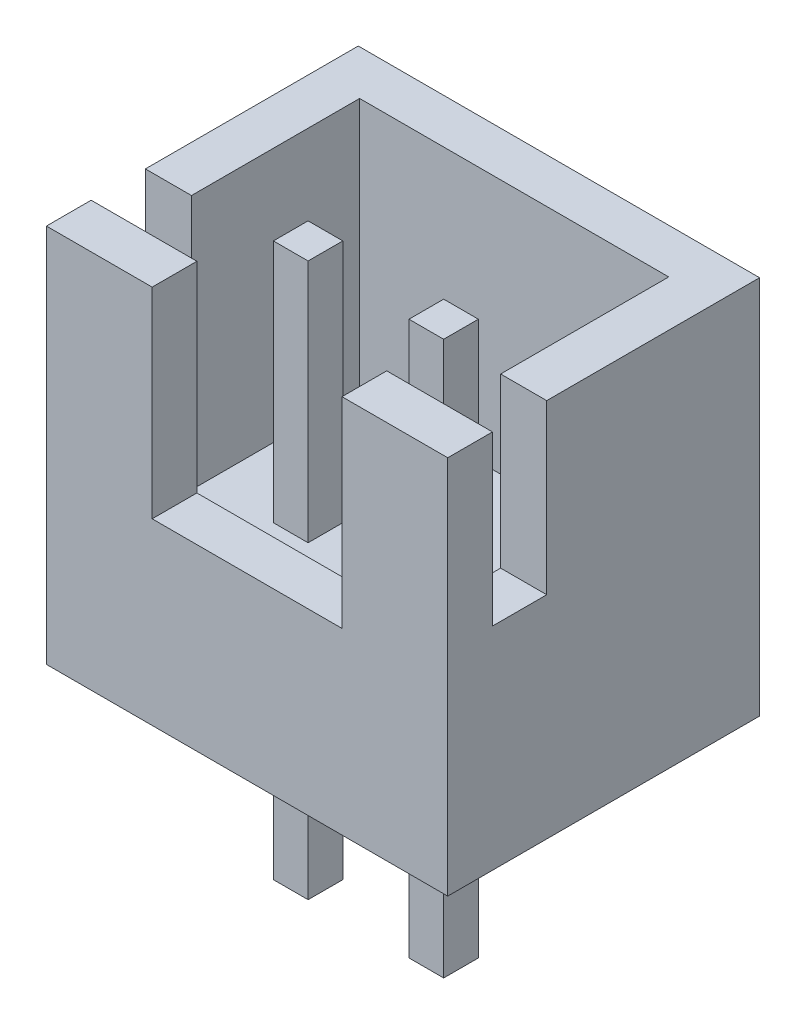
ISO-10303-21;
HEADER;
FILE_DESCRIPTION(('STEP AP214'),'2;1');
FILE_NAME('part.step','',(''),(''),'','','');
FILE_SCHEMA(('AUTOMOTIVE_DESIGN { 1 0 10303 214 1 1 1 1 }'));
ENDSEC;
DATA;
#1=APPLICATION_CONTEXT('core data for automotive mechanical design processes');
#2=APPLICATION_PROTOCOL_DEFINITION('international standard','automotive_design',2000,#1);
#3=PRODUCT_CONTEXT('',#1,'mechanical');
#4=PRODUCT('Part','Part','',(#3));
#5=PRODUCT_RELATED_PRODUCT_CATEGORY('part','',(#4));
#6=PRODUCT_DEFINITION_FORMATION('','',#4);
#7=PRODUCT_DEFINITION_CONTEXT('part definition',#1,'design');
#8=PRODUCT_DEFINITION('design','',#6,#7);
#9=PRODUCT_DEFINITION_SHAPE('','',#8);
#10=(LENGTH_UNIT() NAMED_UNIT(*) SI_UNIT(.MILLI.,.METRE.));
#11=(NAMED_UNIT(*) PLANE_ANGLE_UNIT() SI_UNIT($,.RADIAN.));
#12=(NAMED_UNIT(*) SI_UNIT($,.STERADIAN.) SOLID_ANGLE_UNIT());
#13=UNCERTAINTY_MEASURE_WITH_UNIT(LENGTH_MEASURE(1.E-05),#10,'distance_accuracy_value','');
#14=(GEOMETRIC_REPRESENTATION_CONTEXT(3) GLOBAL_UNCERTAINTY_ASSIGNED_CONTEXT((#13)) GLOBAL_UNIT_ASSIGNED_CONTEXT((#10,
#11,#12)) REPRESENTATION_CONTEXT('',''));
#15=CARTESIAN_POINT('',(0.,0.,0.));
#16=DIRECTION('',(0.,0.,1.));
#17=DIRECTION('',(1.,0.,0.));
#18=AXIS2_PLACEMENT_3D('',#15,#16,#17);
#19=CARTESIAN_POINT('',(0.93,7.705096679919,0.82));
#20=DIRECTION('',(0.,0.,-1.));
#21=DIRECTION('',(-1.,0.,0.));
#22=AXIS2_PLACEMENT_3D('',#19,#20,#21);
#23=PLANE('',#22);
#24=DIRECTION('',(-1.,0.,0.));
#25=VECTOR('',#24,1.);
#26=CARTESIAN_POINT('',(0.93,2.3,0.82));
#27=LINE('',#26,#25);
#28=CARTESIAN_POINT('',(1.57,2.3,0.82));
#29=VERTEX_POINT('',#28);
#30=CARTESIAN_POINT('',(0.93,2.3,0.82));
#31=VERTEX_POINT('',#30);
#32=EDGE_CURVE('E20',#29,#31,#27,.T.);
#33=ORIENTED_EDGE('',*,*,#32,.F.);
#34=DIRECTION('',(0.,1.,0.));
#35=VECTOR('',#34,1.);
#36=CARTESIAN_POINT('',(1.57,7.705096679919,0.82));
#37=LINE('',#36,#35);
#38=CARTESIAN_POINT('',(1.57,6.8,0.82));
#39=VERTEX_POINT('',#38);
#40=EDGE_CURVE('E242',#29,#39,#37,.T.);
#41=ORIENTED_EDGE('',*,*,#40,.T.);
#42=DIRECTION('',(1.,0.,0.));
#43=VECTOR('',#42,1.);
#44=CARTESIAN_POINT('',(0.,6.8,0.82));
#45=LINE('',#44,#43);
#46=CARTESIAN_POINT('',(0.93,6.8,0.82));
#47=VERTEX_POINT('',#46);
#48=EDGE_CURVE('E238',#39,#47,#45,.F.);
#49=ORIENTED_EDGE('',*,*,#48,.T.);
#50=DIRECTION('',(0.,1.,0.));
#51=VECTOR('',#50,1.);
#52=CARTESIAN_POINT('',(0.93,7.705096679919,0.82));
#53=LINE('',#52,#51);
#54=EDGE_CURVE('E240',#47,#31,#53,.F.);
#55=ORIENTED_EDGE('',*,*,#54,.T.);
#56=EDGE_LOOP('',(#33,#41,#49,#55));
#57=FACE_BOUND('',#56,.T.);
#58=ADVANCED_FACE('F17',(#57),#23,.F.);
#59=CARTESIAN_POINT('',(-1.57,7.705096679919,0.82));
#60=DIRECTION('',(0.,0.,-1.));
#61=DIRECTION('',(-1.,0.,0.));
#62=AXIS2_PLACEMENT_3D('',#59,#60,#61);
#63=PLANE('',#62);
#64=DIRECTION('',(-1.,0.,0.));
#65=VECTOR('',#64,1.);
#66=CARTESIAN_POINT('',(-1.57,2.3,0.82));
#67=LINE('',#66,#65);
#68=CARTESIAN_POINT('',(-0.93,2.3,0.82));
#69=VERTEX_POINT('',#68);
#70=CARTESIAN_POINT('',(-1.57,2.3,0.82));
#71=VERTEX_POINT('',#70);
#72=EDGE_CURVE('E248',#69,#71,#67,.T.);
#73=ORIENTED_EDGE('',*,*,#72,.F.);
#74=DIRECTION('',(0.,1.,0.));
#75=VECTOR('',#74,1.);
#76=CARTESIAN_POINT('',(-0.93,7.705096679919,0.82));
#77=LINE('',#76,#75);
#78=CARTESIAN_POINT('',(-0.93,6.8,0.82));
#79=VERTEX_POINT('',#78);
#80=EDGE_CURVE('E363',#69,#79,#77,.T.);
#81=ORIENTED_EDGE('',*,*,#80,.T.);
#82=DIRECTION('',(1.,0.,0.));
#83=VECTOR('',#82,1.);
#84=CARTESIAN_POINT('',(0.,6.8,0.82));
#85=LINE('',#84,#83);
#86=CARTESIAN_POINT('',(-1.57,6.8,0.82));
#87=VERTEX_POINT('',#86);
#88=EDGE_CURVE('E285',#79,#87,#85,.F.);
#89=ORIENTED_EDGE('',*,*,#88,.T.);
#90=DIRECTION('',(0.,1.,0.));
#91=VECTOR('',#90,1.);
#92=CARTESIAN_POINT('',(-1.57,7.705096679919,0.82));
#93=LINE('',#92,#91);
#94=EDGE_CURVE('E277',#87,#71,#93,.F.);
#95=ORIENTED_EDGE('',*,*,#94,.T.);
#96=EDGE_LOOP('',(#73,#81,#89,#95));
#97=FACE_BOUND('',#96,.T.);
#98=ADVANCED_FACE('F284',(#97),#63,.F.);
#99=CARTESIAN_POINT('',(0.,6.8,0.5));
#100=DIRECTION('',(0.,-1.,0.));
#101=DIRECTION('',(0.,0.,-1.));
#102=AXIS2_PLACEMENT_3D('',#99,#100,#101);
#103=PLANE('',#102);
#104=DIRECTION('',(0.,0.,1.));
#105=VECTOR('',#104,1.);
#106=CARTESIAN_POINT('',(1.57,6.8,0.82));
#107=LINE('',#106,#105);
#108=CARTESIAN_POINT('',(1.57,6.8,0.18));
#109=VERTEX_POINT('',#108);
#110=EDGE_CURVE('E295',#39,#109,#107,.F.);
#111=ORIENTED_EDGE('',*,*,#110,.T.);
#112=DIRECTION('',(1.,0.,0.));
#113=VECTOR('',#112,1.);
#114=CARTESIAN_POINT('',(0.93,6.8,0.18));
#115=LINE('',#114,#113);
#116=CARTESIAN_POINT('',(0.93,6.8,0.18));
#117=VERTEX_POINT('',#116);
#118=EDGE_CURVE('E258',#109,#117,#115,.F.);
#119=ORIENTED_EDGE('',*,*,#118,.T.);
#120=DIRECTION('',(0.,0.,-1.));
#121=VECTOR('',#120,1.);
#122=CARTESIAN_POINT('',(0.93,6.8,0.82));
#123=LINE('',#122,#121);
#124=EDGE_CURVE('E247',#117,#47,#123,.F.);
#125=ORIENTED_EDGE('',*,*,#124,.T.);
#126=ORIENTED_EDGE('',*,*,#48,.F.);
#127=EDGE_LOOP('',(#111,#119,#125,#126));
#128=FACE_BOUND('',#127,.T.);
#129=ADVANCED_FACE('F257',(#128),#103,.F.);
#130=CARTESIAN_POINT('',(0.93,7.705096679919,0.82));
#131=DIRECTION('',(1.,0.,0.));
#132=DIRECTION('',(0.,0.,-1.));
#133=AXIS2_PLACEMENT_3D('',#130,#131,#132);
#134=PLANE('',#133);
#135=DIRECTION('',(0.,0.,-1.));
#136=VECTOR('',#135,1.);
#137=CARTESIAN_POINT('',(0.93,2.3,0.82));
#138=LINE('',#137,#136);
#139=CARTESIAN_POINT('',(0.93,2.3,0.18));
#140=VERTEX_POINT('',#139);
#141=EDGE_CURVE('E254',#31,#140,#138,.T.);
#142=ORIENTED_EDGE('',*,*,#141,.F.);
#143=ORIENTED_EDGE('',*,*,#54,.F.);
#144=ORIENTED_EDGE('',*,*,#124,.F.);
#145=DIRECTION('',(0.,1.,0.));
#146=VECTOR('',#145,1.);
#147=CARTESIAN_POINT('',(0.93,7.705096679919,0.18));
#148=LINE('',#147,#146);
#149=EDGE_CURVE('E299',#117,#140,#148,.F.);
#150=ORIENTED_EDGE('',*,*,#149,.T.);
#151=EDGE_LOOP('',(#142,#143,#144,#150));
#152=FACE_BOUND('',#151,.T.);
#153=ADVANCED_FACE('F251',(#152),#134,.F.);
#154=CARTESIAN_POINT('',(1.57,7.705096679919,0.82));
#155=DIRECTION('',(-1.,0.,0.));
#156=DIRECTION('',(0.,0.,1.));
#157=AXIS2_PLACEMENT_3D('',#154,#155,#156);
#158=PLANE('',#157);
#159=DIRECTION('',(0.,0.,1.));
#160=VECTOR('',#159,1.);
#161=CARTESIAN_POINT('',(1.57,2.3,0.82));
#162=LINE('',#161,#160);
#163=CARTESIAN_POINT('',(1.57,2.3,0.18));
#164=VERTEX_POINT('',#163);
#165=EDGE_CURVE('E293',#164,#29,#162,.T.);
#166=ORIENTED_EDGE('',*,*,#165,.F.);
#167=DIRECTION('',(0.,1.,0.));
#168=VECTOR('',#167,1.);
#169=CARTESIAN_POINT('',(1.57,7.705096679919,0.18));
#170=LINE('',#169,#168);
#171=EDGE_CURVE('E301',#164,#109,#170,.T.);
#172=ORIENTED_EDGE('',*,*,#171,.T.);
#173=ORIENTED_EDGE('',*,*,#110,.F.);
#174=ORIENTED_EDGE('',*,*,#40,.F.);
#175=EDGE_LOOP('',(#166,#172,#173,#174));
#176=FACE_BOUND('',#175,.T.);
#177=ADVANCED_FACE('F666',(#176),#158,.F.);
#178=CARTESIAN_POINT('',(0.,6.8,0.5));
#179=DIRECTION('',(0.,-1.,0.));
#180=DIRECTION('',(0.,0.,-1.));
#181=AXIS2_PLACEMENT_3D('',#178,#179,#180);
#182=PLANE('',#181);
#183=DIRECTION('',(0.,0.,1.));
#184=VECTOR('',#183,1.);
#185=CARTESIAN_POINT('',(-0.93,6.8,0.82));
#186=LINE('',#185,#184);
#187=CARTESIAN_POINT('',(-0.93,6.8,0.18));
#188=VERTEX_POINT('',#187);
#189=EDGE_CURVE('E282',#79,#188,#186,.F.);
#190=ORIENTED_EDGE('',*,*,#189,.T.);
#191=DIRECTION('',(1.,0.,0.));
#192=VECTOR('',#191,1.);
#193=CARTESIAN_POINT('',(-1.57,6.8,0.18));
#194=LINE('',#193,#192);
#195=CARTESIAN_POINT('',(-1.57,6.8,0.18));
#196=VERTEX_POINT('',#195);
#197=EDGE_CURVE('E354',#188,#196,#194,.F.);
#198=ORIENTED_EDGE('',*,*,#197,.T.);
#199=DIRECTION('',(0.,0.,-1.));
#200=VECTOR('',#199,1.);
#201=CARTESIAN_POINT('',(-1.57,6.8,0.82));
#202=LINE('',#201,#200);
#203=EDGE_CURVE('E286',#196,#87,#202,.F.);
#204=ORIENTED_EDGE('',*,*,#203,.T.);
#205=ORIENTED_EDGE('',*,*,#88,.F.);
#206=EDGE_LOOP('',(#190,#198,#204,#205));
#207=FACE_BOUND('',#206,.T.);
#208=ADVANCED_FACE('F368',(#207),#182,.F.);
#209=CARTESIAN_POINT('',(-1.57,7.705096679919,0.82));
#210=DIRECTION('',(1.,0.,0.));
#211=DIRECTION('',(0.,0.,-1.));
#212=AXIS2_PLACEMENT_3D('',#209,#210,#211);
#213=PLANE('',#212);
#214=DIRECTION('',(0.,0.,-1.));
#215=VECTOR('',#214,1.);
#216=CARTESIAN_POINT('',(-1.57,2.3,0.82));
#217=LINE('',#216,#215);
#218=CARTESIAN_POINT('',(-1.57,2.3,0.18));
#219=VERTEX_POINT('',#218);
#220=EDGE_CURVE('E267',#71,#219,#217,.T.);
#221=ORIENTED_EDGE('',*,*,#220,.F.);
#222=ORIENTED_EDGE('',*,*,#94,.F.);
#223=ORIENTED_EDGE('',*,*,#203,.F.);
#224=DIRECTION('',(0.,1.,0.));
#225=VECTOR('',#224,1.);
#226=CARTESIAN_POINT('',(-1.57,7.705096679919,0.18));
#227=LINE('',#226,#225);
#228=EDGE_CURVE('E280',#196,#219,#227,.F.);
#229=ORIENTED_EDGE('',*,*,#228,.T.);
#230=EDGE_LOOP('',(#221,#222,#223,#229));
#231=FACE_BOUND('',#230,.T.);
#232=ADVANCED_FACE('F276',(#231),#213,.F.);
#233=CARTESIAN_POINT('',(-0.93,7.705096679919,0.82));
#234=DIRECTION('',(-1.,0.,0.));
#235=DIRECTION('',(0.,0.,1.));
#236=AXIS2_PLACEMENT_3D('',#233,#234,#235);
#237=PLANE('',#236);
#238=DIRECTION('',(0.,0.,1.));
#239=VECTOR('',#238,1.);
#240=CARTESIAN_POINT('',(-0.93,2.3,0.82));
#241=LINE('',#240,#239);
#242=CARTESIAN_POINT('',(-0.93,2.3,0.18));
#243=VERTEX_POINT('',#242);
#244=EDGE_CURVE('E269',#243,#69,#241,.T.);
#245=ORIENTED_EDGE('',*,*,#244,.F.);
#246=DIRECTION('',(0.,1.,0.));
#247=VECTOR('',#246,1.);
#248=CARTESIAN_POINT('',(-0.93,7.705096679919,0.18));
#249=LINE('',#248,#247);
#250=EDGE_CURVE('E350',#243,#188,#249,.T.);
#251=ORIENTED_EDGE('',*,*,#250,.T.);
#252=ORIENTED_EDGE('',*,*,#189,.F.);
#253=ORIENTED_EDGE('',*,*,#80,.F.);
#254=EDGE_LOOP('',(#245,#251,#252,#253));
#255=FACE_BOUND('',#254,.T.);
#256=ADVANCED_FACE('F371',(#255),#237,.F.);
#257=CARTESIAN_POINT('',(0.93,7.705096679919,0.82));
#258=DIRECTION('',(0.,0.,-1.));
#259=DIRECTION('',(-1.,0.,0.));
#260=AXIS2_PLACEMENT_3D('',#257,#258,#259);
#261=PLANE('',#260);
#262=DIRECTION('',(-1.,0.,0.));
#263=VECTOR('',#262,1.);
#264=CARTESIAN_POINT('',(0.93,0.,0.82));
#265=LINE('',#264,#263);
#266=CARTESIAN_POINT('',(0.93,0.,0.82));
#267=VERTEX_POINT('',#266);
#268=CARTESIAN_POINT('',(1.57,0.,0.82));
#269=VERTEX_POINT('',#268);
#270=EDGE_CURVE('E361',#267,#269,#265,.F.);
#271=ORIENTED_EDGE('',*,*,#270,.F.);
#272=DIRECTION('',(0.,1.,0.));
#273=VECTOR('',#272,1.);
#274=CARTESIAN_POINT('',(0.93,7.705096679919,0.82));
#275=LINE('',#274,#273);
#276=CARTESIAN_POINT('',(0.93,-3.4,0.82));
#277=VERTEX_POINT('',#276);
#278=EDGE_CURVE('E331',#267,#277,#275,.F.);
#279=ORIENTED_EDGE('',*,*,#278,.T.);
#280=DIRECTION('',(1.,0.,0.));
#281=VECTOR('',#280,1.);
#282=CARTESIAN_POINT('',(0.93,-3.4,0.82));
#283=LINE('',#282,#281);
#284=CARTESIAN_POINT('',(1.57,-3.4,0.82));
#285=VERTEX_POINT('',#284);
#286=EDGE_CURVE('E348',#285,#277,#283,.F.);
#287=ORIENTED_EDGE('',*,*,#286,.F.);
#288=DIRECTION('',(0.,1.,0.));
#289=VECTOR('',#288,1.);
#290=CARTESIAN_POINT('',(1.57,7.705096679919,0.82));
#291=LINE('',#290,#289);
#292=EDGE_CURVE('E342',#285,#269,#291,.T.);
#293=ORIENTED_EDGE('',*,*,#292,.T.);
#294=EDGE_LOOP('',(#271,#279,#287,#293));
#295=FACE_BOUND('',#294,.T.);
#296=ADVANCED_FACE('F505',(#295),#261,.F.);
#297=CARTESIAN_POINT('',(-1.57,7.705096679919,0.82));
#298=DIRECTION('',(0.,0.,-1.));
#299=DIRECTION('',(-1.,0.,0.));
#300=AXIS2_PLACEMENT_3D('',#297,#298,#299);
#301=PLANE('',#300);
#302=DIRECTION('',(-1.,0.,0.));
#303=VECTOR('',#302,1.);
#304=CARTESIAN_POINT('',(-1.57,0.,0.82));
#305=LINE('',#304,#303);
#306=CARTESIAN_POINT('',(-1.57,0.,0.82));
#307=VERTEX_POINT('',#306);
#308=CARTESIAN_POINT('',(-0.93,0.,0.82));
#309=VERTEX_POINT('',#308);
#310=EDGE_CURVE('E359',#307,#309,#305,.F.);
#311=ORIENTED_EDGE('',*,*,#310,.F.);
#312=DIRECTION('',(0.,1.,0.));
#313=VECTOR('',#312,1.);
#314=CARTESIAN_POINT('',(-1.57,7.705096679919,0.82));
#315=LINE('',#314,#313);
#316=CARTESIAN_POINT('',(-1.57,-3.4,0.82));
#317=VERTEX_POINT('',#316);
#318=EDGE_CURVE('E307',#307,#317,#315,.F.);
#319=ORIENTED_EDGE('',*,*,#318,.T.);
#320=DIRECTION('',(1.,0.,0.));
#321=VECTOR('',#320,1.);
#322=CARTESIAN_POINT('',(-1.57,-3.4,0.82));
#323=LINE('',#322,#321);
#324=CARTESIAN_POINT('',(-0.93,-3.4,0.82));
#325=VERTEX_POINT('',#324);
#326=EDGE_CURVE('E329',#325,#317,#323,.F.);
#327=ORIENTED_EDGE('',*,*,#326,.F.);
#328=DIRECTION('',(0.,1.,0.));
#329=VECTOR('',#328,1.);
#330=CARTESIAN_POINT('',(-0.93,7.705096679919,0.82));
#331=LINE('',#330,#329);
#332=EDGE_CURVE('E323',#325,#309,#331,.T.);
#333=ORIENTED_EDGE('',*,*,#332,.T.);
#334=EDGE_LOOP('',(#311,#319,#327,#333));
#335=FACE_BOUND('',#334,.T.);
#336=ADVANCED_FACE('F385',(#335),#301,.F.);
#337=CARTESIAN_POINT('',(0.93,7.705096679919,0.18));
#338=DIRECTION('',(0.,0.,1.));
#339=DIRECTION('',(1.,0.,0.));
#340=AXIS2_PLACEMENT_3D('',#337,#338,#339);
#341=PLANE('',#340);
#342=DIRECTION('',(1.,0.,0.));
#343=VECTOR('',#342,1.);
#344=CARTESIAN_POINT('',(-2.85,2.3,0.18));
#345=LINE('',#344,#343);
#346=EDGE_CURVE('E298',#164,#140,#345,.F.);
#347=ORIENTED_EDGE('',*,*,#346,.T.);
#348=ORIENTED_EDGE('',*,*,#149,.F.);
#349=ORIENTED_EDGE('',*,*,#118,.F.);
#350=ORIENTED_EDGE('',*,*,#171,.F.);
#351=EDGE_LOOP('',(#347,#348,#349,#350));
#352=FACE_BOUND('',#351,.T.);
#353=ADVANCED_FACE('F304',(#352),#341,.F.);
#354=CARTESIAN_POINT('',(-1.57,7.705096679919,0.18));
#355=DIRECTION('',(0.,0.,1.));
#356=DIRECTION('',(1.,0.,0.));
#357=AXIS2_PLACEMENT_3D('',#354,#355,#356);
#358=PLANE('',#357);
#359=DIRECTION('',(1.,0.,0.));
#360=VECTOR('',#359,1.);
#361=CARTESIAN_POINT('',(-2.85,2.3,0.18));
#362=LINE('',#361,#360);
#363=EDGE_CURVE('E306',#243,#219,#362,.F.);
#364=ORIENTED_EDGE('',*,*,#363,.T.);
#365=ORIENTED_EDGE('',*,*,#228,.F.);
#366=ORIENTED_EDGE('',*,*,#197,.F.);
#367=ORIENTED_EDGE('',*,*,#250,.F.);
#368=EDGE_LOOP('',(#364,#365,#366,#367));
#369=FACE_BOUND('',#368,.T.);
#370=ADVANCED_FACE('F373',(#369),#358,.F.);
#371=CARTESIAN_POINT('',(0.93,-3.4,0.18));
#372=DIRECTION('',(0.,-1.,0.));
#373=DIRECTION('',(0.,0.,-1.));
#374=AXIS2_PLACEMENT_3D('',#371,#372,#373);
#375=PLANE('',#374);
#376=DIRECTION('',(0.,0.,1.));
#377=VECTOR('',#376,1.);
#378=CARTESIAN_POINT('',(1.57,-3.4,0.82));
#379=LINE('',#378,#377);
#380=CARTESIAN_POINT('',(1.57,-3.4,0.18));
#381=VERTEX_POINT('',#380);
#382=EDGE_CURVE('E345',#381,#285,#379,.T.);
#383=ORIENTED_EDGE('',*,*,#382,.T.);
#384=ORIENTED_EDGE('',*,*,#286,.T.);
#385=DIRECTION('',(0.,0.,-1.));
#386=VECTOR('',#385,1.);
#387=CARTESIAN_POINT('',(0.93,-3.4,0.82));
#388=LINE('',#387,#386);
#389=CARTESIAN_POINT('',(0.93,-3.4,0.18));
#390=VERTEX_POINT('',#389);
#391=EDGE_CURVE('E337',#277,#390,#388,.T.);
#392=ORIENTED_EDGE('',*,*,#391,.T.);
#393=DIRECTION('',(1.,0.,0.));
#394=VECTOR('',#393,1.);
#395=CARTESIAN_POINT('',(0.93,-3.4,0.18));
#396=LINE('',#395,#394);
#397=EDGE_CURVE('E517',#390,#381,#396,.T.);
#398=ORIENTED_EDGE('',*,*,#397,.T.);
#399=EDGE_LOOP('',(#383,#384,#392,#398));
#400=FACE_BOUND('',#399,.T.);
#401=ADVANCED_FACE('F375',(#400),#375,.T.);
#402=CARTESIAN_POINT('',(1.57,7.705096679919,0.82));
#403=DIRECTION('',(-1.,0.,0.));
#404=DIRECTION('',(0.,0.,1.));
#405=AXIS2_PLACEMENT_3D('',#402,#403,#404);
#406=PLANE('',#405);
#407=DIRECTION('',(0.,0.,1.));
#408=VECTOR('',#407,1.);
#409=CARTESIAN_POINT('',(1.57,0.,0.82));
#410=LINE('',#409,#408);
#411=CARTESIAN_POINT('',(1.57,0.,0.18));
#412=VERTEX_POINT('',#411);
#413=EDGE_CURVE('E340',#269,#412,#410,.F.);
#414=ORIENTED_EDGE('',*,*,#413,.F.);
#415=ORIENTED_EDGE('',*,*,#292,.F.);
#416=ORIENTED_EDGE('',*,*,#382,.F.);
#417=DIRECTION('',(0.,1.,0.));
#418=VECTOR('',#417,1.);
#419=CARTESIAN_POINT('',(1.57,7.705096679919,0.18));
#420=LINE('',#419,#418);
#421=EDGE_CURVE('E500',#381,#412,#420,.T.);
#422=ORIENTED_EDGE('',*,*,#421,.T.);
#423=EDGE_LOOP('',(#414,#415,#416,#422));
#424=FACE_BOUND('',#423,.T.);
#425=ADVANCED_FACE('F382',(#424),#406,.F.);
#426=CARTESIAN_POINT('',(0.93,7.705096679919,0.82));
#427=DIRECTION('',(1.,0.,0.));
#428=DIRECTION('',(0.,0.,-1.));
#429=AXIS2_PLACEMENT_3D('',#426,#427,#428);
#430=PLANE('',#429);
#431=DIRECTION('',(0.,0.,-1.));
#432=VECTOR('',#431,1.);
#433=CARTESIAN_POINT('',(0.93,0.,0.82));
#434=LINE('',#433,#432);
#435=CARTESIAN_POINT('',(0.93,0.,0.18));
#436=VERTEX_POINT('',#435);
#437=EDGE_CURVE('E334',#436,#267,#434,.F.);
#438=ORIENTED_EDGE('',*,*,#437,.F.);
#439=DIRECTION('',(0.,1.,0.));
#440=VECTOR('',#439,1.);
#441=CARTESIAN_POINT('',(0.93,7.705096679919,0.18));
#442=LINE('',#441,#440);
#443=EDGE_CURVE('E511',#436,#390,#442,.F.);
#444=ORIENTED_EDGE('',*,*,#443,.T.);
#445=ORIENTED_EDGE('',*,*,#391,.F.);
#446=ORIENTED_EDGE('',*,*,#278,.F.);
#447=EDGE_LOOP('',(#438,#444,#445,#446));
#448=FACE_BOUND('',#447,.T.);
#449=ADVANCED_FACE('F487',(#448),#430,.F.);
#450=CARTESIAN_POINT('',(-1.57,-3.4,0.18));
#451=DIRECTION('',(0.,-1.,0.));
#452=DIRECTION('',(0.,0.,-1.));
#453=AXIS2_PLACEMENT_3D('',#450,#451,#452);
#454=PLANE('',#453);
#455=DIRECTION('',(0.,0.,1.));
#456=VECTOR('',#455,1.);
#457=CARTESIAN_POINT('',(-0.93,-3.4,0.82));
#458=LINE('',#457,#456);
#459=CARTESIAN_POINT('',(-0.93,-3.4,0.18));
#460=VERTEX_POINT('',#459);
#461=EDGE_CURVE('E326',#460,#325,#458,.T.);
#462=ORIENTED_EDGE('',*,*,#461,.T.);
#463=ORIENTED_EDGE('',*,*,#326,.T.);
#464=DIRECTION('',(0.,0.,-1.));
#465=VECTOR('',#464,1.);
#466=CARTESIAN_POINT('',(-1.57,-3.4,0.82));
#467=LINE('',#466,#465);
#468=CARTESIAN_POINT('',(-1.57,-3.4,0.18));
#469=VERTEX_POINT('',#468);
#470=EDGE_CURVE('E318',#317,#469,#467,.T.);
#471=ORIENTED_EDGE('',*,*,#470,.T.);
#472=DIRECTION('',(1.,0.,0.));
#473=VECTOR('',#472,1.);
#474=CARTESIAN_POINT('',(-1.57,-3.4,0.18));
#475=LINE('',#474,#473);
#476=EDGE_CURVE('E512',#469,#460,#475,.T.);
#477=ORIENTED_EDGE('',*,*,#476,.T.);
#478=EDGE_LOOP('',(#462,#463,#471,#477));
#479=FACE_BOUND('',#478,.T.);
#480=ADVANCED_FACE('F483',(#479),#454,.T.);
#481=CARTESIAN_POINT('',(-0.93,7.705096679919,0.82));
#482=DIRECTION('',(-1.,0.,0.));
#483=DIRECTION('',(0.,0.,1.));
#484=AXIS2_PLACEMENT_3D('',#481,#482,#483);
#485=PLANE('',#484);
#486=DIRECTION('',(0.,0.,1.));
#487=VECTOR('',#486,1.);
#488=CARTESIAN_POINT('',(-0.93,0.,0.82));
#489=LINE('',#488,#487);
#490=CARTESIAN_POINT('',(-0.93,0.,0.18));
#491=VERTEX_POINT('',#490);
#492=EDGE_CURVE('E321',#309,#491,#489,.F.);
#493=ORIENTED_EDGE('',*,*,#492,.F.);
#494=ORIENTED_EDGE('',*,*,#332,.F.);
#495=ORIENTED_EDGE('',*,*,#461,.F.);
#496=DIRECTION('',(0.,1.,0.));
#497=VECTOR('',#496,1.);
#498=CARTESIAN_POINT('',(-0.93,7.705096679919,0.18));
#499=LINE('',#498,#497);
#500=EDGE_CURVE('E515',#460,#491,#499,.T.);
#501=ORIENTED_EDGE('',*,*,#500,.T.);
#502=EDGE_LOOP('',(#493,#494,#495,#501));
#503=FACE_BOUND('',#502,.T.);
#504=ADVANCED_FACE('F479',(#503),#485,.F.);
#505=CARTESIAN_POINT('',(-1.57,7.705096679919,0.82));
#506=DIRECTION('',(1.,0.,0.));
#507=DIRECTION('',(0.,0.,-1.));
#508=AXIS2_PLACEMENT_3D('',#505,#506,#507);
#509=PLANE('',#508);
#510=DIRECTION('',(0.,0.,-1.));
#511=VECTOR('',#510,1.);
#512=CARTESIAN_POINT('',(-1.57,0.,0.82));
#513=LINE('',#512,#511);
#514=CARTESIAN_POINT('',(-1.57,0.,0.18));
#515=VERTEX_POINT('',#514);
#516=EDGE_CURVE('E312',#515,#307,#513,.F.);
#517=ORIENTED_EDGE('',*,*,#516,.F.);
#518=DIRECTION('',(0.,1.,0.));
#519=VECTOR('',#518,1.);
#520=CARTESIAN_POINT('',(-1.57,7.705096679919,0.18));
#521=LINE('',#520,#519);
#522=EDGE_CURVE('E641',#515,#469,#521,.F.);
#523=ORIENTED_EDGE('',*,*,#522,.T.);
#524=ORIENTED_EDGE('',*,*,#470,.F.);
#525=ORIENTED_EDGE('',*,*,#318,.F.);
#526=EDGE_LOOP('',(#517,#523,#524,#525));
#527=FACE_BOUND('',#526,.T.);
#528=ADVANCED_FACE('F476',(#527),#509,.F.);
#529=CARTESIAN_POINT('',(-2.85,2.3,-2.05));
#530=DIRECTION('',(0.,-1.,0.));
#531=DIRECTION('',(0.,0.,-1.));
#532=AXIS2_PLACEMENT_3D('',#529,#530,#531);
#533=PLANE('',#532);
#534=ORIENTED_EDGE('',*,*,#244,.T.);
#535=ORIENTED_EDGE('',*,*,#72,.T.);
#536=ORIENTED_EDGE('',*,*,#220,.T.);
#537=ORIENTED_EDGE('',*,*,#363,.F.);
#538=EDGE_LOOP('',(#534,#535,#536,#537));
#539=FACE_BOUND('',#538,.T.);
#540=DIRECTION('',(1.,0.,0.));
#541=VECTOR('',#540,1.);
#542=CARTESIAN_POINT('',(3.7,2.3,2.05));
#543=LINE('',#542,#541);
#544=CARTESIAN_POINT('',(-2.85,2.3,2.05));
#545=VERTEX_POINT('',#544);
#546=CARTESIAN_POINT('',(2.85,2.3,2.05));
#547=VERTEX_POINT('',#546);
#548=EDGE_CURVE('E605',#545,#547,#543,.T.);
#549=ORIENTED_EDGE('',*,*,#548,.T.);
#550=DIRECTION('',(0.,0.,-1.));
#551=VECTOR('',#550,1.);
#552=CARTESIAN_POINT('',(2.85,2.3,2.05));
#553=LINE('',#552,#551);
#554=CARTESIAN_POINT('',(2.85,2.3,-2.05));
#555=VERTEX_POINT('',#554);
#556=EDGE_CURVE('E630',#547,#555,#553,.T.);
#557=ORIENTED_EDGE('',*,*,#556,.T.);
#558=DIRECTION('',(-1.,0.,0.));
#559=VECTOR('',#558,1.);
#560=CARTESIAN_POINT('',(-2.85,2.3,-2.05));
#561=LINE('',#560,#559);
#562=CARTESIAN_POINT('',(-2.85,2.3,-2.05));
#563=VERTEX_POINT('',#562);
#564=EDGE_CURVE('E625',#555,#563,#561,.T.);
#565=ORIENTED_EDGE('',*,*,#564,.T.);
#566=DIRECTION('',(0.,0.,1.));
#567=VECTOR('',#566,1.);
#568=CARTESIAN_POINT('',(-2.85,2.3,2.05));
#569=LINE('',#568,#567);
#570=EDGE_CURVE('E620',#563,#545,#569,.T.);
#571=ORIENTED_EDGE('',*,*,#570,.T.);
#572=EDGE_LOOP('',(#549,#557,#565,#571));
#573=FACE_BOUND('',#572,.T.);
#574=ORIENTED_EDGE('',*,*,#165,.T.);
#575=ORIENTED_EDGE('',*,*,#32,.T.);
#576=ORIENTED_EDGE('',*,*,#141,.T.);
#577=ORIENTED_EDGE('',*,*,#346,.F.);
#578=EDGE_LOOP('',(#574,#575,#576,#577));
#579=FACE_BOUND('',#578,.T.);
#580=ADVANCED_FACE('F264',(#539,#573,#579),#533,.F.);
#581=CARTESIAN_POINT('',(3.7,7.,2.875));
#582=DIRECTION('',(0.,-1.,0.));
#583=DIRECTION('',(0.,0.,-1.));
#584=AXIS2_PLACEMENT_3D('',#581,#582,#583);
#585=PLANE('',#584);
#586=DIRECTION('',(0.,0.,1.));
#587=VECTOR('',#586,1.);
#588=CARTESIAN_POINT('',(1.75,7.,-3.043132631299));
#589=LINE('',#588,#587);
#590=CARTESIAN_POINT('',(1.75,7.,2.05));
#591=VERTEX_POINT('',#590);
#592=CARTESIAN_POINT('',(1.75,7.,2.875));
#593=VERTEX_POINT('',#592);
#594=EDGE_CURVE('E531',#591,#593,#589,.T.);
#595=ORIENTED_EDGE('',*,*,#594,.T.);
#596=DIRECTION('',(-1.,0.,0.));
#597=VECTOR('',#596,1.);
#598=CARTESIAN_POINT('',(3.7,7.,2.875));
#599=LINE('',#598,#597);
#600=CARTESIAN_POINT('',(3.7,7.,2.875));
#601=VERTEX_POINT('',#600);
#602=EDGE_CURVE('E544',#593,#601,#599,.F.);
#603=ORIENTED_EDGE('',*,*,#602,.T.);
#604=DIRECTION('',(0.,0.,-1.));
#605=VECTOR('',#604,1.);
#606=CARTESIAN_POINT('',(3.7,7.,2.875));
#607=LINE('',#606,#605);
#608=CARTESIAN_POINT('',(3.7,7.,2.05));
#609=VERTEX_POINT('',#608);
#610=EDGE_CURVE('E309',#609,#601,#607,.F.);
#611=ORIENTED_EDGE('',*,*,#610,.F.);
#612=DIRECTION('',(1.,0.,0.));
#613=VECTOR('',#612,1.);
#614=CARTESIAN_POINT('',(3.7,7.,2.05));
#615=LINE('',#614,#613);
#616=EDGE_CURVE('E598',#609,#591,#615,.F.);
#617=ORIENTED_EDGE('',*,*,#616,.T.);
#618=EDGE_LOOP('',(#595,#603,#611,#617));
#619=FACE_BOUND('',#618,.T.);
#620=ADVANCED_FACE('F469',(#619),#585,.F.);
#621=CARTESIAN_POINT('',(1.75,7.,-3.043132631299));
#622=DIRECTION('',(1.,0.,0.));
#623=DIRECTION('',(0.,1.,0.));
#624=AXIS2_PLACEMENT_3D('',#621,#622,#623);
#625=PLANE('',#624);
#626=DIRECTION('',(0.,0.,1.));
#627=VECTOR('',#626,1.);
#628=CARTESIAN_POINT('',(1.75,3.3,-3.043132631299));
#629=LINE('',#628,#627);
#630=CARTESIAN_POINT('',(1.75,3.3,2.05));
#631=VERTEX_POINT('',#630);
#632=CARTESIAN_POINT('',(1.75,3.3,2.875));
#633=VERTEX_POINT('',#632);
#634=EDGE_CURVE('E528',#631,#633,#629,.T.);
#635=ORIENTED_EDGE('',*,*,#634,.T.);
#636=DIRECTION('',(0.,1.,0.));
#637=VECTOR('',#636,1.);
#638=CARTESIAN_POINT('',(1.75,0.,2.875));
#639=LINE('',#638,#637);
#640=EDGE_CURVE('E547',#633,#593,#639,.T.);
#641=ORIENTED_EDGE('',*,*,#640,.T.);
#642=ORIENTED_EDGE('',*,*,#594,.F.);
#643=DIRECTION('',(0.,-1.,0.));
#644=VECTOR('',#643,1.);
#645=CARTESIAN_POINT('',(1.75,7.,2.05));
#646=LINE('',#645,#644);
#647=EDGE_CURVE('E595',#591,#631,#646,.T.);
#648=ORIENTED_EDGE('',*,*,#647,.T.);
#649=EDGE_LOOP('',(#635,#641,#642,#648));
#650=FACE_BOUND('',#649,.T.);
#651=ADVANCED_FACE('F465',(#650),#625,.F.);
#652=CARTESIAN_POINT('',(-1.75,3.3,-3.043132631299));
#653=DIRECTION('',(0.,-1.,0.));
#654=DIRECTION('',(1.,0.,0.));
#655=AXIS2_PLACEMENT_3D('',#652,#653,#654);
#656=PLANE('',#655);
#657=DIRECTION('',(0.,0.,1.));
#658=VECTOR('',#657,1.);
#659=CARTESIAN_POINT('',(-1.75,3.3,-3.043132631299));
#660=LINE('',#659,#658);
#661=CARTESIAN_POINT('',(-1.75,3.3,2.05));
#662=VERTEX_POINT('',#661);
#663=CARTESIAN_POINT('',(-1.75,3.3,2.875));
#664=VERTEX_POINT('',#663);
#665=EDGE_CURVE('E526',#662,#664,#660,.T.);
#666=ORIENTED_EDGE('',*,*,#665,.T.);
#667=DIRECTION('',(-1.,0.,0.));
#668=VECTOR('',#667,1.);
#669=CARTESIAN_POINT('',(3.7,3.3,2.875));
#670=LINE('',#669,#668);
#671=EDGE_CURVE('E611',#664,#633,#670,.F.);
#672=ORIENTED_EDGE('',*,*,#671,.T.);
#673=ORIENTED_EDGE('',*,*,#634,.F.);
#674=DIRECTION('',(1.,0.,0.));
#675=VECTOR('',#674,1.);
#676=CARTESIAN_POINT('',(3.7,3.3,2.05));
#677=LINE('',#676,#675);
#678=EDGE_CURVE('E592',#631,#662,#677,.F.);
#679=ORIENTED_EDGE('',*,*,#678,.T.);
#680=EDGE_LOOP('',(#666,#672,#673,#679));
#681=FACE_BOUND('',#680,.T.);
#682=ADVANCED_FACE('F461',(#681),#656,.F.);
#683=CARTESIAN_POINT('',(-1.75,7.,-3.043132631299));
#684=DIRECTION('',(-1.,0.,0.));
#685=DIRECTION('',(0.,-1.,0.));
#686=AXIS2_PLACEMENT_3D('',#683,#684,#685);
#687=PLANE('',#686);
#688=DIRECTION('',(0.,0.,-1.));
#689=VECTOR('',#688,1.);
#690=CARTESIAN_POINT('',(-1.75,7.,2.875));
#691=LINE('',#690,#689);
#692=CARTESIAN_POINT('',(-1.75,7.,2.05));
#693=VERTEX_POINT('',#692);
#694=CARTESIAN_POINT('',(-1.75,7.,2.875));
#695=VERTEX_POINT('',#694);
#696=EDGE_CURVE('E522',#693,#695,#691,.F.);
#697=ORIENTED_EDGE('',*,*,#696,.T.);
#698=DIRECTION('',(0.,1.,0.));
#699=VECTOR('',#698,1.);
#700=CARTESIAN_POINT('',(-1.75,0.,2.875));
#701=LINE('',#700,#699);
#702=EDGE_CURVE('E614',#695,#664,#701,.F.);
#703=ORIENTED_EDGE('',*,*,#702,.T.);
#704=ORIENTED_EDGE('',*,*,#665,.F.);
#705=DIRECTION('',(0.,-1.,0.));
#706=VECTOR('',#705,1.);
#707=CARTESIAN_POINT('',(-1.75,7.,2.05));
#708=LINE('',#707,#706);
#709=EDGE_CURVE('E589',#662,#693,#708,.F.);
#710=ORIENTED_EDGE('',*,*,#709,.T.);
#711=EDGE_LOOP('',(#697,#703,#704,#710));
#712=FACE_BOUND('',#711,.T.);
#713=ADVANCED_FACE('F457',(#712),#687,.F.);
#714=CARTESIAN_POINT('',(3.7,7.,2.875));
#715=DIRECTION('',(0.,-1.,0.));
#716=DIRECTION('',(0.,0.,-1.));
#717=AXIS2_PLACEMENT_3D('',#714,#715,#716);
#718=PLANE('',#717);
#719=ORIENTED_EDGE('',*,*,#696,.F.);
#720=DIRECTION('',(1.,0.,0.));
#721=VECTOR('',#720,1.);
#722=CARTESIAN_POINT('',(3.7,7.,2.05));
#723=LINE('',#722,#721);
#724=CARTESIAN_POINT('',(-3.7,7.,2.05));
#725=VERTEX_POINT('',#724);
#726=EDGE_CURVE('E586',#693,#725,#723,.F.);
#727=ORIENTED_EDGE('',*,*,#726,.T.);
#728=DIRECTION('',(0.,0.,-1.));
#729=VECTOR('',#728,1.);
#730=CARTESIAN_POINT('',(-3.7,7.,2.875));
#731=LINE('',#730,#729);
#732=CARTESIAN_POINT('',(-3.7,7.,2.875));
#733=VERTEX_POINT('',#732);
#734=EDGE_CURVE('E524',#733,#725,#731,.T.);
#735=ORIENTED_EDGE('',*,*,#734,.F.);
#736=DIRECTION('',(-1.,0.,0.));
#737=VECTOR('',#736,1.);
#738=CARTESIAN_POINT('',(3.7,7.,2.875));
#739=LINE('',#738,#737);
#740=EDGE_CURVE('E546',#733,#695,#739,.F.);
#741=ORIENTED_EDGE('',*,*,#740,.T.);
#742=EDGE_LOOP('',(#719,#727,#735,#741));
#743=FACE_BOUND('',#742,.T.);
#744=ADVANCED_FACE('F453',(#743),#718,.F.);
#745=CARTESIAN_POINT('',(0.93,7.705096679919,0.18));
#746=DIRECTION('',(0.,0.,1.));
#747=DIRECTION('',(1.,0.,0.));
#748=AXIS2_PLACEMENT_3D('',#745,#746,#747);
#749=PLANE('',#748);
#750=DIRECTION('',(1.,0.,0.));
#751=VECTOR('',#750,1.);
#752=CARTESIAN_POINT('',(3.7,0.,0.18));
#753=LINE('',#752,#751);
#754=EDGE_CURVE('E572',#436,#412,#753,.T.);
#755=ORIENTED_EDGE('',*,*,#754,.T.);
#756=ORIENTED_EDGE('',*,*,#421,.F.);
#757=ORIENTED_EDGE('',*,*,#397,.F.);
#758=ORIENTED_EDGE('',*,*,#443,.F.);
#759=EDGE_LOOP('',(#755,#756,#757,#758));
#760=FACE_BOUND('',#759,.T.);
#761=ADVANCED_FACE('F449',(#760),#749,.F.);
#762=CARTESIAN_POINT('',(-1.57,7.705096679919,0.18));
#763=DIRECTION('',(0.,0.,1.));
#764=DIRECTION('',(1.,0.,0.));
#765=AXIS2_PLACEMENT_3D('',#762,#763,#764);
#766=PLANE('',#765);
#767=DIRECTION('',(1.,0.,0.));
#768=VECTOR('',#767,1.);
#769=CARTESIAN_POINT('',(3.7,0.,0.18));
#770=LINE('',#769,#768);
#771=EDGE_CURVE('E568',#515,#491,#770,.T.);
#772=ORIENTED_EDGE('',*,*,#771,.T.);
#773=ORIENTED_EDGE('',*,*,#500,.F.);
#774=ORIENTED_EDGE('',*,*,#476,.F.);
#775=ORIENTED_EDGE('',*,*,#522,.F.);
#776=EDGE_LOOP('',(#772,#773,#774,#775));
#777=FACE_BOUND('',#776,.T.);
#778=ADVANCED_FACE('F445',(#777),#766,.F.);
#779=CARTESIAN_POINT('',(3.7,3.9,2.05));
#780=DIRECTION('',(0.,-1.,0.));
#781=DIRECTION('',(0.,0.,-1.));
#782=AXIS2_PLACEMENT_3D('',#779,#780,#781);
#783=PLANE('',#782);
#784=DIRECTION('',(0.,0.,-1.));
#785=VECTOR('',#784,1.);
#786=CARTESIAN_POINT('',(2.85,3.9,2.05));
#787=LINE('',#786,#785);
#788=CARTESIAN_POINT('',(2.85,3.9,1.05));
#789=VERTEX_POINT('',#788);
#790=CARTESIAN_POINT('',(2.85,3.9,2.05));
#791=VERTEX_POINT('',#790);
#792=EDGE_CURVE('E632',#789,#791,#787,.F.);
#793=ORIENTED_EDGE('',*,*,#792,.T.);
#794=DIRECTION('',(1.,0.,0.));
#795=VECTOR('',#794,1.);
#796=CARTESIAN_POINT('',(3.7,3.9,2.05));
#797=LINE('',#796,#795);
#798=CARTESIAN_POINT('',(3.7,3.9,2.05));
#799=VERTEX_POINT('',#798);
#800=EDGE_CURVE('E600',#791,#799,#797,.T.);
#801=ORIENTED_EDGE('',*,*,#800,.T.);
#802=DIRECTION('',(0.,0.,1.));
#803=VECTOR('',#802,1.);
#804=CARTESIAN_POINT('',(3.7,3.9,2.875));
#805=LINE('',#804,#803);
#806=CARTESIAN_POINT('',(3.7,3.9,1.05));
#807=VERTEX_POINT('',#806);
#808=EDGE_CURVE('E564',#799,#807,#805,.F.);
#809=ORIENTED_EDGE('',*,*,#808,.T.);
#810=DIRECTION('',(-1.,0.,0.));
#811=VECTOR('',#810,1.);
#812=CARTESIAN_POINT('',(3.7,3.9,1.05));
#813=LINE('',#812,#811);
#814=EDGE_CURVE('E639',#807,#789,#813,.T.);
#815=ORIENTED_EDGE('',*,*,#814,.T.);
#816=EDGE_LOOP('',(#793,#801,#809,#815));
#817=FACE_BOUND('',#816,.T.);
#818=ADVANCED_FACE('F441',(#817),#783,.F.);
#819=CARTESIAN_POINT('',(3.7,3.9,1.05));
#820=DIRECTION('',(0.,0.,-1.));
#821=DIRECTION('',(-1.,0.,0.));
#822=AXIS2_PLACEMENT_3D('',#819,#820,#821);
#823=PLANE('',#822);
#824=DIRECTION('',(0.,1.,0.));
#825=VECTOR('',#824,1.);
#826=CARTESIAN_POINT('',(2.85,2.3,1.05));
#827=LINE('',#826,#825);
#828=CARTESIAN_POINT('',(2.85,7.,1.05));
#829=VERTEX_POINT('',#828);
#830=EDGE_CURVE('E634',#829,#789,#827,.F.);
#831=ORIENTED_EDGE('',*,*,#830,.T.);
#832=ORIENTED_EDGE('',*,*,#814,.F.);
#833=DIRECTION('',(0.,1.,0.));
#834=VECTOR('',#833,1.);
#835=CARTESIAN_POINT('',(3.7,7.,1.05));
#836=LINE('',#835,#834);
#837=CARTESIAN_POINT('',(3.7,7.,1.05));
#838=VERTEX_POINT('',#837);
#839=EDGE_CURVE('E558',#807,#838,#836,.T.);
#840=ORIENTED_EDGE('',*,*,#839,.T.);
#841=DIRECTION('',(-1.,0.,0.));
#842=VECTOR('',#841,1.);
#843=CARTESIAN_POINT('',(3.7,7.,1.05));
#844=LINE('',#843,#842);
#845=EDGE_CURVE('E637',#829,#838,#844,.F.);
#846=ORIENTED_EDGE('',*,*,#845,.F.);
#847=EDGE_LOOP('',(#831,#832,#840,#846));
#848=FACE_BOUND('',#847,.T.);
#849=ADVANCED_FACE('F437',(#848),#823,.F.);
#850=CARTESIAN_POINT('',(2.85,2.3,2.05));
#851=DIRECTION('',(1.,0.,0.));
#852=DIRECTION('',(0.,0.,-1.));
#853=AXIS2_PLACEMENT_3D('',#850,#851,#852);
#854=PLANE('',#853);
#855=DIRECTION('',(0.,1.,0.));
#856=VECTOR('',#855,1.);
#857=CARTESIAN_POINT('',(2.85,2.3,-2.05));
#858=LINE('',#857,#856);
#859=CARTESIAN_POINT('',(2.85,7.,-2.05));
#860=VERTEX_POINT('',#859);
#861=EDGE_CURVE('E627',#860,#555,#858,.F.);
#862=ORIENTED_EDGE('',*,*,#861,.T.);
#863=ORIENTED_EDGE('',*,*,#556,.F.);
#864=DIRECTION('',(0.,-1.,0.));
#865=VECTOR('',#864,1.);
#866=CARTESIAN_POINT('',(2.85,7.,2.05));
#867=LINE('',#866,#865);
#868=EDGE_CURVE('E602',#547,#791,#867,.F.);
#869=ORIENTED_EDGE('',*,*,#868,.T.);
#870=ORIENTED_EDGE('',*,*,#792,.F.);
#871=ORIENTED_EDGE('',*,*,#830,.F.);
#872=DIRECTION('',(0.,0.,-1.));
#873=VECTOR('',#872,1.);
#874=CARTESIAN_POINT('',(2.85,7.,1.05));
#875=LINE('',#874,#873);
#876=EDGE_CURVE('E556',#829,#860,#875,.T.);
#877=ORIENTED_EDGE('',*,*,#876,.T.);
#878=EDGE_LOOP('',(#862,#863,#869,#870,#871,#877));
#879=FACE_BOUND('',#878,.T.);
#880=ADVANCED_FACE('F433',(#879),#854,.F.);
#881=CARTESIAN_POINT('',(-2.85,2.3,-2.05));
#882=DIRECTION('',(0.,0.,-1.));
#883=DIRECTION('',(-1.,0.,0.));
#884=AXIS2_PLACEMENT_3D('',#881,#882,#883);
#885=PLANE('',#884);
#886=DIRECTION('',(0.,1.,0.));
#887=VECTOR('',#886,1.);
#888=CARTESIAN_POINT('',(-2.85,2.3,-2.05));
#889=LINE('',#888,#887);
#890=CARTESIAN_POINT('',(-2.85,7.,-2.05));
#891=VERTEX_POINT('',#890);
#892=EDGE_CURVE('E622',#891,#563,#889,.F.);
#893=ORIENTED_EDGE('',*,*,#892,.T.);
#894=ORIENTED_EDGE('',*,*,#564,.F.);
#895=ORIENTED_EDGE('',*,*,#861,.F.);
#896=DIRECTION('',(1.,0.,0.));
#897=VECTOR('',#896,1.);
#898=CARTESIAN_POINT('',(3.7,7.,-2.05));
#899=LINE('',#898,#897);
#900=EDGE_CURVE('E1010',#860,#891,#899,.F.);
#901=ORIENTED_EDGE('',*,*,#900,.T.);
#902=EDGE_LOOP('',(#893,#894,#895,#901));
#903=FACE_BOUND('',#902,.T.);
#904=ADVANCED_FACE('F429',(#903),#885,.F.);
#905=CARTESIAN_POINT('',(-2.85,2.3,2.05));
#906=DIRECTION('',(-1.,0.,0.));
#907=DIRECTION('',(0.,0.,1.));
#908=AXIS2_PLACEMENT_3D('',#905,#906,#907);
#909=PLANE('',#908);
#910=DIRECTION('',(0.,-1.,0.));
#911=VECTOR('',#910,1.);
#912=CARTESIAN_POINT('',(-2.85,7.,2.05));
#913=LINE('',#912,#911);
#914=CARTESIAN_POINT('',(-2.85,3.9,2.05));
#915=VERTEX_POINT('',#914);
#916=EDGE_CURVE('E608',#915,#545,#913,.T.);
#917=ORIENTED_EDGE('',*,*,#916,.T.);
#918=ORIENTED_EDGE('',*,*,#570,.F.);
#919=ORIENTED_EDGE('',*,*,#892,.F.);
#920=DIRECTION('',(0.,0.,-1.));
#921=VECTOR('',#920,1.);
#922=CARTESIAN_POINT('',(-2.85,7.,1.05));
#923=LINE('',#922,#921);
#924=CARTESIAN_POINT('',(-2.85,7.,1.05));
#925=VERTEX_POINT('',#924);
#926=EDGE_CURVE('E1007',#891,#925,#923,.F.);
#927=ORIENTED_EDGE('',*,*,#926,.T.);
#928=DIRECTION('',(0.,1.,0.));
#929=VECTOR('',#928,1.);
#930=CARTESIAN_POINT('',(-2.85,3.9,1.05));
#931=LINE('',#930,#929);
#932=CARTESIAN_POINT('',(-2.85,3.9,1.05));
#933=VERTEX_POINT('',#932);
#934=EDGE_CURVE('E577',#925,#933,#931,.F.);
#935=ORIENTED_EDGE('',*,*,#934,.T.);
#936=DIRECTION('',(0.,0.,-1.));
#937=VECTOR('',#936,1.);
#938=CARTESIAN_POINT('',(-2.85,3.9,2.05));
#939=LINE('',#938,#937);
#940=EDGE_CURVE('E583',#933,#915,#939,.F.);
#941=ORIENTED_EDGE('',*,*,#940,.T.);
#942=EDGE_LOOP('',(#917,#918,#919,#927,#935,#941));
#943=FACE_BOUND('',#942,.T.);
#944=ADVANCED_FACE('F425',(#943),#909,.F.);
#945=CARTESIAN_POINT('',(3.7,0.,2.875));
#946=DIRECTION('',(0.,0.,-1.));
#947=DIRECTION('',(-1.,0.,0.));
#948=AXIS2_PLACEMENT_3D('',#945,#946,#947);
#949=PLANE('',#948);
#950=ORIENTED_EDGE('',*,*,#702,.F.);
#951=ORIENTED_EDGE('',*,*,#740,.F.);
#952=DIRECTION('',(0.,1.,0.));
#953=VECTOR('',#952,1.);
#954=CARTESIAN_POINT('',(-3.7,7.,2.875));
#955=LINE('',#954,#953);
#956=CARTESIAN_POINT('',(-3.7,0.,2.875));
#957=VERTEX_POINT('',#956);
#958=EDGE_CURVE('E1001',#957,#733,#955,.T.);
#959=ORIENTED_EDGE('',*,*,#958,.F.);
#960=DIRECTION('',(1.,0.,0.));
#961=VECTOR('',#960,1.);
#962=CARTESIAN_POINT('',(3.7,0.,2.875));
#963=LINE('',#962,#961);
#964=CARTESIAN_POINT('',(3.7,0.,2.875));
#965=VERTEX_POINT('',#964);
#966=EDGE_CURVE('E551',#957,#965,#963,.T.);
#967=ORIENTED_EDGE('',*,*,#966,.T.);
#968=DIRECTION('',(0.,1.,0.));
#969=VECTOR('',#968,1.);
#970=CARTESIAN_POINT('',(3.7,7.,2.875));
#971=LINE('',#970,#969);
#972=EDGE_CURVE('E536',#965,#601,#971,.T.);
#973=ORIENTED_EDGE('',*,*,#972,.T.);
#974=ORIENTED_EDGE('',*,*,#602,.F.);
#975=ORIENTED_EDGE('',*,*,#640,.F.);
#976=ORIENTED_EDGE('',*,*,#671,.F.);
#977=EDGE_LOOP('',(#950,#951,#959,#967,#973,#974,#975,#976));
#978=FACE_BOUND('',#977,.T.);
#979=ADVANCED_FACE('F421',(#978),#949,.F.);
#980=CARTESIAN_POINT('',(3.7,7.,2.05));
#981=DIRECTION('',(0.,0.,1.));
#982=DIRECTION('',(0.,-1.,0.));
#983=AXIS2_PLACEMENT_3D('',#980,#981,#982);
#984=PLANE('',#983);
#985=ORIENTED_EDGE('',*,*,#709,.F.);
#986=ORIENTED_EDGE('',*,*,#678,.F.);
#987=ORIENTED_EDGE('',*,*,#647,.F.);
#988=ORIENTED_EDGE('',*,*,#616,.F.);
#989=DIRECTION('',(0.,1.,0.));
#990=VECTOR('',#989,1.);
#991=CARTESIAN_POINT('',(3.7,7.,2.05));
#992=LINE('',#991,#990);
#993=EDGE_CURVE('E540',#609,#799,#992,.F.);
#994=ORIENTED_EDGE('',*,*,#993,.T.);
#995=ORIENTED_EDGE('',*,*,#800,.F.);
#996=ORIENTED_EDGE('',*,*,#868,.F.);
#997=ORIENTED_EDGE('',*,*,#548,.F.);
#998=ORIENTED_EDGE('',*,*,#916,.F.);
#999=DIRECTION('',(1.,0.,0.));
#1000=VECTOR('',#999,1.);
#1001=CARTESIAN_POINT('',(3.7,3.9,2.05));
#1002=LINE('',#1001,#1000);
#1003=CARTESIAN_POINT('',(-3.7,3.9,2.05));
#1004=VERTEX_POINT('',#1003);
#1005=EDGE_CURVE('E580',#915,#1004,#1002,.F.);
#1006=ORIENTED_EDGE('',*,*,#1005,.T.);
#1007=DIRECTION('',(0.,1.,0.));
#1008=VECTOR('',#1007,1.);
#1009=CARTESIAN_POINT('',(-3.7,7.,2.05));
#1010=LINE('',#1009,#1008);
#1011=EDGE_CURVE('E999',#725,#1004,#1010,.F.);
#1012=ORIENTED_EDGE('',*,*,#1011,.F.);
#1013=ORIENTED_EDGE('',*,*,#726,.F.);
#1014=EDGE_LOOP('',(#985,#986,#987,#988,#994,#995,#996,#997,#998,#1006,#1012,#1013));
#1015=FACE_BOUND('',#1014,.T.);
#1016=ADVANCED_FACE('F417',(#1015),#984,.F.);
#1017=CARTESIAN_POINT('',(3.7,3.9,2.05));
#1018=DIRECTION('',(0.,-1.,0.));
#1019=DIRECTION('',(0.,0.,-1.));
#1020=AXIS2_PLACEMENT_3D('',#1017,#1018,#1019);
#1021=PLANE('',#1020);
#1022=ORIENTED_EDGE('',*,*,#940,.F.);
#1023=DIRECTION('',(-1.,0.,0.));
#1024=VECTOR('',#1023,1.);
#1025=CARTESIAN_POINT('',(3.7,3.9,1.05));
#1026=LINE('',#1025,#1024);
#1027=CARTESIAN_POINT('',(-3.7,3.9,1.05));
#1028=VERTEX_POINT('',#1027);
#1029=EDGE_CURVE('E574',#933,#1028,#1026,.T.);
#1030=ORIENTED_EDGE('',*,*,#1029,.T.);
#1031=DIRECTION('',(0.,0.,1.));
#1032=VECTOR('',#1031,1.);
#1033=CARTESIAN_POINT('',(-3.7,3.9,2.875));
#1034=LINE('',#1033,#1032);
#1035=EDGE_CURVE('E997',#1004,#1028,#1034,.F.);
#1036=ORIENTED_EDGE('',*,*,#1035,.F.);
#1037=ORIENTED_EDGE('',*,*,#1005,.F.);
#1038=EDGE_LOOP('',(#1022,#1030,#1036,#1037));
#1039=FACE_BOUND('',#1038,.T.);
#1040=ADVANCED_FACE('F413',(#1039),#1021,.F.);
#1041=CARTESIAN_POINT('',(3.7,3.9,1.05));
#1042=DIRECTION('',(0.,0.,-1.));
#1043=DIRECTION('',(-1.,0.,0.));
#1044=AXIS2_PLACEMENT_3D('',#1041,#1042,#1043);
#1045=PLANE('',#1044);
#1046=ORIENTED_EDGE('',*,*,#934,.F.);
#1047=DIRECTION('',(1.,0.,0.));
#1048=VECTOR('',#1047,1.);
#1049=CARTESIAN_POINT('',(3.7,7.,1.05));
#1050=LINE('',#1049,#1048);
#1051=CARTESIAN_POINT('',(-3.7,7.,1.05));
#1052=VERTEX_POINT('',#1051);
#1053=EDGE_CURVE('E1004',#925,#1052,#1050,.F.);
#1054=ORIENTED_EDGE('',*,*,#1053,.T.);
#1055=DIRECTION('',(0.,1.,0.));
#1056=VECTOR('',#1055,1.);
#1057=CARTESIAN_POINT('',(-3.7,7.,1.05));
#1058=LINE('',#1057,#1056);
#1059=EDGE_CURVE('E995',#1028,#1052,#1058,.T.);
#1060=ORIENTED_EDGE('',*,*,#1059,.F.);
#1061=ORIENTED_EDGE('',*,*,#1029,.F.);
#1062=EDGE_LOOP('',(#1046,#1054,#1060,#1061));
#1063=FACE_BOUND('',#1062,.T.);
#1064=ADVANCED_FACE('F409',(#1063),#1045,.F.);
#1065=CARTESIAN_POINT('',(3.7,0.,2.875));
#1066=DIRECTION('',(0.,1.,0.));
#1067=DIRECTION('',(0.,0.,1.));
#1068=AXIS2_PLACEMENT_3D('',#1065,#1066,#1067);
#1069=PLANE('',#1068);
#1070=ORIENTED_EDGE('',*,*,#516,.T.);
#1071=ORIENTED_EDGE('',*,*,#310,.T.);
#1072=ORIENTED_EDGE('',*,*,#492,.T.);
#1073=ORIENTED_EDGE('',*,*,#771,.F.);
#1074=EDGE_LOOP('',(#1070,#1071,#1072,#1073));
#1075=FACE_BOUND('',#1074,.T.);
#1076=DIRECTION('',(1.,0.,0.));
#1077=VECTOR('',#1076,1.);
#1078=CARTESIAN_POINT('',(3.7,0.,-2.875));
#1079=LINE('',#1078,#1077);
#1080=CARTESIAN_POINT('',(-3.7,0.,-2.875));
#1081=VERTEX_POINT('',#1080);
#1082=CARTESIAN_POINT('',(3.7,0.,-2.875));
#1083=VERTEX_POINT('',#1082);
#1084=EDGE_CURVE('E983',#1081,#1083,#1079,.T.);
#1085=ORIENTED_EDGE('',*,*,#1084,.T.);
#1086=DIRECTION('',(0.,0.,1.));
#1087=VECTOR('',#1086,1.);
#1088=CARTESIAN_POINT('',(3.7,0.,2.875));
#1089=LINE('',#1088,#1087);
#1090=EDGE_CURVE('E553',#1083,#965,#1089,.T.);
#1091=ORIENTED_EDGE('',*,*,#1090,.T.);
#1092=ORIENTED_EDGE('',*,*,#966,.F.);
#1093=DIRECTION('',(0.,0.,1.));
#1094=VECTOR('',#1093,1.);
#1095=CARTESIAN_POINT('',(-3.7,0.,2.875));
#1096=LINE('',#1095,#1094);
#1097=EDGE_CURVE('E985',#1081,#957,#1096,.T.);
#1098=ORIENTED_EDGE('',*,*,#1097,.F.);
#1099=EDGE_LOOP('',(#1085,#1091,#1092,#1098));
#1100=FACE_BOUND('',#1099,.T.);
#1101=ORIENTED_EDGE('',*,*,#437,.T.);
#1102=ORIENTED_EDGE('',*,*,#270,.T.);
#1103=ORIENTED_EDGE('',*,*,#413,.T.);
#1104=ORIENTED_EDGE('',*,*,#754,.F.);
#1105=EDGE_LOOP('',(#1101,#1102,#1103,#1104));
#1106=FACE_BOUND('',#1105,.T.);
#1107=ADVANCED_FACE('F405',(#1075,#1100,#1106),#1069,.F.);
#1108=CARTESIAN_POINT('',(3.7,7.,2.875));
#1109=DIRECTION('',(-1.,0.,0.));
#1110=DIRECTION('',(0.,0.,1.));
#1111=AXIS2_PLACEMENT_3D('',#1108,#1109,#1110);
#1112=PLANE('',#1111);
#1113=ORIENTED_EDGE('',*,*,#1090,.F.);
#1114=DIRECTION('',(0.,1.,0.));
#1115=VECTOR('',#1114,1.);
#1116=CARTESIAN_POINT('',(3.7,0.,-2.875));
#1117=LINE('',#1116,#1115);
#1118=CARTESIAN_POINT('',(3.7,7.,-2.875));
#1119=VERTEX_POINT('',#1118);
#1120=EDGE_CURVE('E987',#1083,#1119,#1117,.T.);
#1121=ORIENTED_EDGE('',*,*,#1120,.T.);
#1122=DIRECTION('',(0.,0.,-1.));
#1123=VECTOR('',#1122,1.);
#1124=CARTESIAN_POINT('',(3.7,7.,1.05));
#1125=LINE('',#1124,#1123);
#1126=EDGE_CURVE('E552',#1119,#838,#1125,.F.);
#1127=ORIENTED_EDGE('',*,*,#1126,.T.);
#1128=ORIENTED_EDGE('',*,*,#839,.F.);
#1129=ORIENTED_EDGE('',*,*,#808,.F.);
#1130=ORIENTED_EDGE('',*,*,#993,.F.);
#1131=ORIENTED_EDGE('',*,*,#610,.T.);
#1132=ORIENTED_EDGE('',*,*,#972,.F.);
#1133=EDGE_LOOP('',(#1113,#1121,#1127,#1128,#1129,#1130,#1131,#1132));
#1134=FACE_BOUND('',#1133,.T.);
#1135=ADVANCED_FACE('F401',(#1134),#1112,.F.);
#1136=CARTESIAN_POINT('',(3.7,7.,1.05));
#1137=DIRECTION('',(0.,-1.,0.));
#1138=DIRECTION('',(0.,0.,-1.));
#1139=AXIS2_PLACEMENT_3D('',#1136,#1137,#1138);
#1140=PLANE('',#1139);
#1141=ORIENTED_EDGE('',*,*,#926,.F.);
#1142=ORIENTED_EDGE('',*,*,#900,.F.);
#1143=ORIENTED_EDGE('',*,*,#876,.F.);
#1144=ORIENTED_EDGE('',*,*,#845,.T.);
#1145=ORIENTED_EDGE('',*,*,#1126,.F.);
#1146=DIRECTION('',(1.,0.,0.));
#1147=VECTOR('',#1146,1.);
#1148=CARTESIAN_POINT('',(3.7,7.,-2.875));
#1149=LINE('',#1148,#1147);
#1150=CARTESIAN_POINT('',(-3.7,7.,-2.875));
#1151=VERTEX_POINT('',#1150);
#1152=EDGE_CURVE('E26',#1119,#1151,#1149,.F.);
#1153=ORIENTED_EDGE('',*,*,#1152,.T.);
#1154=DIRECTION('',(0.,0.,1.));
#1155=VECTOR('',#1154,1.);
#1156=CARTESIAN_POINT('',(-3.7,7.,2.875));
#1157=LINE('',#1156,#1155);
#1158=EDGE_CURVE('E34',#1052,#1151,#1157,.F.);
#1159=ORIENTED_EDGE('',*,*,#1158,.F.);
#1160=ORIENTED_EDGE('',*,*,#1053,.F.);
#1161=EDGE_LOOP('',(#1141,#1142,#1143,#1144,#1145,#1153,#1159,#1160));
#1162=FACE_BOUND('',#1161,.T.);
#1163=ADVANCED_FACE('F395',(#1162),#1140,.F.);
#1164=CARTESIAN_POINT('',(-3.7,7.,2.875));
#1165=DIRECTION('',(-1.,0.,0.));
#1166=DIRECTION('',(0.,0.,1.));
#1167=AXIS2_PLACEMENT_3D('',#1164,#1165,#1166);
#1168=PLANE('',#1167);
#1169=DIRECTION('',(0.,1.,0.));
#1170=VECTOR('',#1169,1.);
#1171=CARTESIAN_POINT('',(-3.7,0.,-2.875));
#1172=LINE('',#1171,#1170);
#1173=EDGE_CURVE('E11',#1151,#1081,#1172,.F.);
#1174=ORIENTED_EDGE('',*,*,#1173,.T.);
#1175=ORIENTED_EDGE('',*,*,#1097,.T.);
#1176=ORIENTED_EDGE('',*,*,#958,.T.);
#1177=ORIENTED_EDGE('',*,*,#734,.T.);
#1178=ORIENTED_EDGE('',*,*,#1011,.T.);
#1179=ORIENTED_EDGE('',*,*,#1035,.T.);
#1180=ORIENTED_EDGE('',*,*,#1059,.T.);
#1181=ORIENTED_EDGE('',*,*,#1158,.T.);
#1182=EDGE_LOOP('',(#1174,#1175,#1176,#1177,#1178,#1179,#1180,#1181));
#1183=FACE_BOUND('',#1182,.T.);
#1184=ADVANCED_FACE('F389',(#1183),#1168,.T.);
#1185=CARTESIAN_POINT('',(3.7,0.,-2.875));
#1186=DIRECTION('',(0.,0.,1.));
#1187=DIRECTION('',(1.,0.,0.));
#1188=AXIS2_PLACEMENT_3D('',#1185,#1186,#1187);
#1189=PLANE('',#1188);
#1190=ORIENTED_EDGE('',*,*,#1152,.F.);
#1191=ORIENTED_EDGE('',*,*,#1120,.F.);
#1192=ORIENTED_EDGE('',*,*,#1084,.F.);
#1193=ORIENTED_EDGE('',*,*,#1173,.F.);
#1194=EDGE_LOOP('',(#1190,#1191,#1192,#1193));
#1195=FACE_BOUND('',#1194,.T.);
#1196=ADVANCED_FACE('F387',(#1195),#1189,.F.);
#1197=CLOSED_SHELL('',(#58,#98,#129,#153,#177,#208,#232,#256,#296,#336,#353,#370,#401,#425,#449,
#480,#504,#528,#580,#620,#651,#682,#713,#744,#761,#778,#818,#849,#880,#904,#944,#979,#1016,
#1040,#1064,#1107,#1135,#1163,#1184,#1196));
#1198=MANIFOLD_SOLID_BREP('B1',#1197);
#1199=ADVANCED_BREP_SHAPE_REPRESENTATION('',(#18,#1198),#14);
#1200=SHAPE_DEFINITION_REPRESENTATION(#9,#1199);
ENDSEC;
END-ISO-10303-21;
